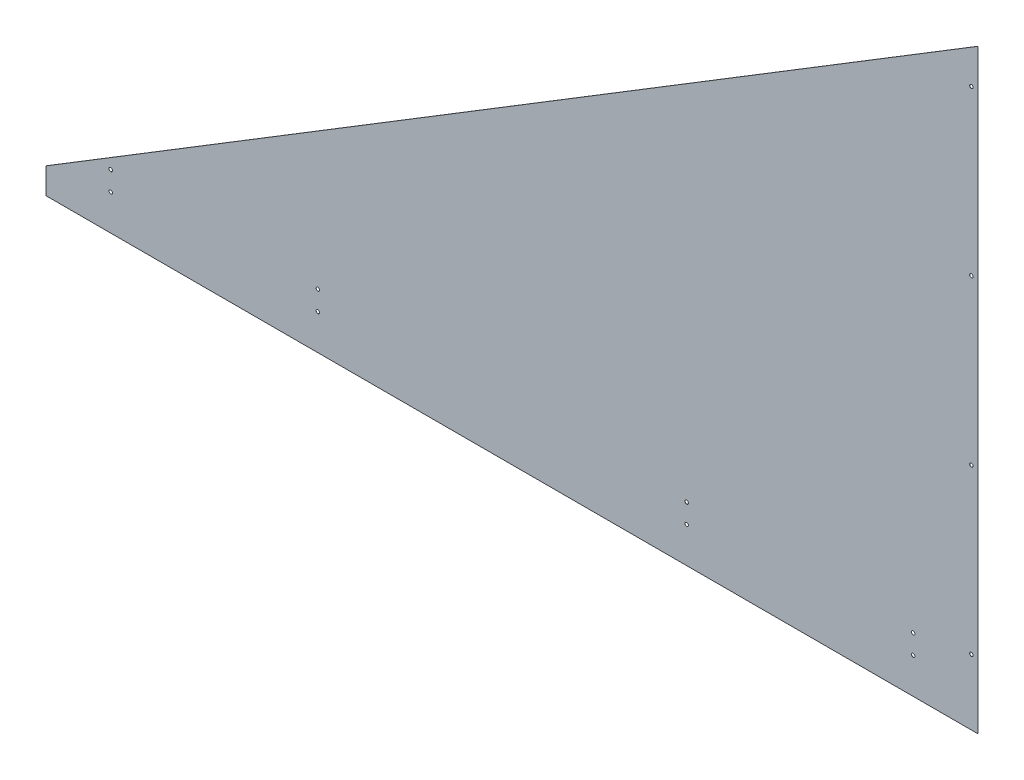
ISO-10303-21;
HEADER;
FILE_DESCRIPTION(('STEP AP214'),'2;1');
FILE_NAME('part.step','',(''),(''),'','','');
FILE_SCHEMA(('AUTOMOTIVE_DESIGN { 1 0 10303 214 1 1 1 1 }'));
ENDSEC;
DATA;
#1=APPLICATION_CONTEXT('core data for automotive mechanical design processes');
#2=APPLICATION_PROTOCOL_DEFINITION('international standard','automotive_design',2000,#1);
#3=PRODUCT_CONTEXT('',#1,'mechanical');
#4=PRODUCT('Part','Part','',(#3));
#5=PRODUCT_RELATED_PRODUCT_CATEGORY('part','',(#4));
#6=PRODUCT_DEFINITION_FORMATION('','',#4);
#7=PRODUCT_DEFINITION_CONTEXT('part definition',#1,'design');
#8=PRODUCT_DEFINITION('design','',#6,#7);
#9=PRODUCT_DEFINITION_SHAPE('','',#8);
#10=(LENGTH_UNIT() NAMED_UNIT(*) SI_UNIT(.MILLI.,.METRE.));
#11=(NAMED_UNIT(*) PLANE_ANGLE_UNIT() SI_UNIT($,.RADIAN.));
#12=(NAMED_UNIT(*) SI_UNIT($,.STERADIAN.) SOLID_ANGLE_UNIT());
#13=UNCERTAINTY_MEASURE_WITH_UNIT(LENGTH_MEASURE(1.E-05),#10,'distance_accuracy_value','');
#14=(GEOMETRIC_REPRESENTATION_CONTEXT(3) GLOBAL_UNCERTAINTY_ASSIGNED_CONTEXT((#13)) GLOBAL_UNIT_ASSIGNED_CONTEXT((#10,
#11,#12)) REPRESENTATION_CONTEXT('',''));
#15=CARTESIAN_POINT('',(0.,0.,0.));
#16=DIRECTION('',(0.,0.,1.));
#17=DIRECTION('',(1.,0.,0.));
#18=AXIS2_PLACEMENT_3D('',#15,#16,#17);
#19=CARTESIAN_POINT('',(0.,0.,0.));
#20=DIRECTION('',(0.,0.,1.));
#21=DIRECTION('',(1.,0.,0.));
#22=AXIS2_PLACEMENT_3D('',#19,#20,#21);
#23=PLANE('',#22);
#24=CARTESIAN_POINT('',(1816.1,77.7875,0.));
#25=DIRECTION('',(0.,0.,-1.));
#26=DIRECTION('',(-1.,0.,0.));
#27=AXIS2_PLACEMENT_3D('',#24,#25,#26);
#28=CIRCLE('',#27,3.3782);
#29=CARTESIAN_POINT('',(1812.7218,77.7875,0.));
#30=VERTEX_POINT('',#29);
#31=EDGE_CURVE('E95',#30,#30,#28,.T.);
#32=ORIENTED_EDGE('',*,*,#31,.F.);
#33=EDGE_LOOP('',(#32));
#34=FACE_BOUND('',#33,.T.);
#35=CARTESIAN_POINT('',(1816.1,399.520833333333,0.));
#36=DIRECTION('',(0.,0.,-1.));
#37=DIRECTION('',(-1.,0.,0.));
#38=AXIS2_PLACEMENT_3D('',#35,#36,#37);
#39=CIRCLE('',#38,3.3782);
#40=CARTESIAN_POINT('',(1812.7218,399.520833333333,0.));
#41=VERTEX_POINT('',#40);
#42=EDGE_CURVE('E103',#41,#41,#39,.T.);
#43=ORIENTED_EDGE('',*,*,#42,.F.);
#44=EDGE_LOOP('',(#43));
#45=FACE_BOUND('',#44,.T.);
#46=CARTESIAN_POINT('',(1816.1,721.254166666667,0.));
#47=DIRECTION('',(0.,0.,-1.));
#48=DIRECTION('',(-1.,0.,0.));
#49=AXIS2_PLACEMENT_3D('',#46,#47,#48);
#50=CIRCLE('',#49,3.3782);
#51=CARTESIAN_POINT('',(1812.7218,721.254166666667,0.));
#52=VERTEX_POINT('',#51);
#53=EDGE_CURVE('E106',#52,#52,#50,.T.);
#54=ORIENTED_EDGE('',*,*,#53,.F.);
#55=EDGE_LOOP('',(#54));
#56=FACE_BOUND('',#55,.T.);
#57=CARTESIAN_POINT('',(1816.1,1042.9875,0.));
#58=DIRECTION('',(0.,0.,-1.));
#59=DIRECTION('',(-1.,0.,0.));
#60=AXIS2_PLACEMENT_3D('',#57,#58,#59);
#61=CIRCLE('',#60,3.3782);
#62=CARTESIAN_POINT('',(1812.7218,1042.9875,0.));
#63=VERTEX_POINT('',#62);
#64=EDGE_CURVE('E109',#63,#63,#61,.T.);
#65=ORIENTED_EDGE('',*,*,#64,.F.);
#66=EDGE_LOOP('',(#65));
#67=FACE_BOUND('',#66,.T.);
#68=CARTESIAN_POINT('',(1701.8,19.05,0.));
#69=DIRECTION('',(0.,0.,-1.));
#70=DIRECTION('',(-1.,0.,0.));
#71=AXIS2_PLACEMENT_3D('',#68,#69,#70);
#72=CIRCLE('',#71,3.3782);
#73=CARTESIAN_POINT('',(1698.4218,19.05,0.));
#74=VERTEX_POINT('',#73);
#75=EDGE_CURVE('E112',#74,#74,#72,.T.);
#76=ORIENTED_EDGE('',*,*,#75,.F.);
#77=EDGE_LOOP('',(#76));
#78=FACE_BOUND('',#77,.T.);
#79=CARTESIAN_POINT('',(1701.8,57.15,0.));
#80=DIRECTION('',(0.,0.,-1.));
#81=DIRECTION('',(-1.,0.,0.));
#82=AXIS2_PLACEMENT_3D('',#79,#80,#81);
#83=CIRCLE('',#82,3.3782);
#84=CARTESIAN_POINT('',(1698.4218,57.15,0.));
#85=VERTEX_POINT('',#84);
#86=EDGE_CURVE('E115',#85,#85,#83,.T.);
#87=ORIENTED_EDGE('',*,*,#86,.F.);
#88=EDGE_LOOP('',(#87));
#89=FACE_BOUND('',#88,.T.);
#90=CARTESIAN_POINT('',(1257.3,57.15,0.));
#91=DIRECTION('',(0.,0.,-1.));
#92=DIRECTION('',(-1.,0.,0.));
#93=AXIS2_PLACEMENT_3D('',#90,#91,#92);
#94=CIRCLE('',#93,3.3782);
#95=CARTESIAN_POINT('',(1253.9218,57.15,0.));
#96=VERTEX_POINT('',#95);
#97=EDGE_CURVE('E118',#96,#96,#94,.T.);
#98=ORIENTED_EDGE('',*,*,#97,.F.);
#99=EDGE_LOOP('',(#98));
#100=FACE_BOUND('',#99,.T.);
#101=CARTESIAN_POINT('',(1257.3,19.05,0.));
#102=DIRECTION('',(0.,0.,-1.));
#103=DIRECTION('',(-1.,0.,0.));
#104=AXIS2_PLACEMENT_3D('',#101,#102,#103);
#105=CIRCLE('',#104,3.3782);
#106=CARTESIAN_POINT('',(1253.9218,19.05,0.));
#107=VERTEX_POINT('',#106);
#108=EDGE_CURVE('E121',#107,#107,#105,.T.);
#109=ORIENTED_EDGE('',*,*,#108,.F.);
#110=EDGE_LOOP('',(#109));
#111=FACE_BOUND('',#110,.T.);
#112=CARTESIAN_POINT('',(533.4,57.15,0.));
#113=DIRECTION('',(0.,0.,-1.));
#114=DIRECTION('',(-1.,0.,0.));
#115=AXIS2_PLACEMENT_3D('',#112,#113,#114);
#116=CIRCLE('',#115,3.3782);
#117=CARTESIAN_POINT('',(530.0218,57.15,0.));
#118=VERTEX_POINT('',#117);
#119=EDGE_CURVE('E124',#118,#118,#116,.T.);
#120=ORIENTED_EDGE('',*,*,#119,.F.);
#121=EDGE_LOOP('',(#120));
#122=FACE_BOUND('',#121,.T.);
#123=CARTESIAN_POINT('',(533.4,19.05,0.));
#124=DIRECTION('',(0.,0.,-1.));
#125=DIRECTION('',(-1.,0.,0.));
#126=AXIS2_PLACEMENT_3D('',#123,#124,#125);
#127=CIRCLE('',#126,3.3782);
#128=CARTESIAN_POINT('',(530.0218,19.05,0.));
#129=VERTEX_POINT('',#128);
#130=EDGE_CURVE('E127',#129,#129,#127,.T.);
#131=ORIENTED_EDGE('',*,*,#130,.F.);
#132=EDGE_LOOP('',(#131));
#133=FACE_BOUND('',#132,.T.);
#134=CARTESIAN_POINT('',(127.,19.05,0.));
#135=DIRECTION('',(0.,0.,-1.));
#136=DIRECTION('',(-1.,0.,0.));
#137=AXIS2_PLACEMENT_3D('',#134,#135,#136);
#138=CIRCLE('',#137,3.3782);
#139=CARTESIAN_POINT('',(123.6218,19.05,0.));
#140=VERTEX_POINT('',#139);
#141=EDGE_CURVE('E133',#140,#140,#138,.T.);
#142=ORIENTED_EDGE('',*,*,#141,.F.);
#143=EDGE_LOOP('',(#142));
#144=FACE_BOUND('',#143,.T.);
#145=DIRECTION('',(0.,1.,0.));
#146=VECTOR('',#145,1.);
#147=CARTESIAN_POINT('',(1828.8,1117.6,0.));
#148=LINE('',#147,#146);
#149=CARTESIAN_POINT('',(1828.8,-50.8,0.));
#150=VERTEX_POINT('',#149);
#151=CARTESIAN_POINT('',(1828.8,1117.6,0.));
#152=VERTEX_POINT('',#151);
#153=EDGE_CURVE('E136',#150,#152,#148,.T.);
#154=ORIENTED_EDGE('',*,*,#153,.F.);
#155=DIRECTION('',(-1.,0.,0.));
#156=VECTOR('',#155,1.);
#157=CARTESIAN_POINT('',(1828.8,-50.8,0.));
#158=LINE('',#157,#156);
#159=CARTESIAN_POINT('',(0.,-50.8,0.));
#160=VERTEX_POINT('',#159);
#161=EDGE_CURVE('E97',#150,#160,#158,.T.);
#162=ORIENTED_EDGE('',*,*,#161,.T.);
#163=DIRECTION('',(0.,1.,0.));
#164=VECTOR('',#163,1.);
#165=CARTESIAN_POINT('',(0.,0.,0.));
#166=LINE('',#165,#164);
#167=CARTESIAN_POINT('',(0.,0.,0.));
#168=VERTEX_POINT('',#167);
#169=EDGE_CURVE('E92',#160,#168,#166,.T.);
#170=ORIENTED_EDGE('',*,*,#169,.T.);
#171=DIRECTION('',(-0.853281833651959,-0.521450009453975,0.));
#172=VECTOR('',#171,1.);
#173=CARTESIAN_POINT('',(0.,0.,0.));
#174=LINE('',#173,#172);
#175=EDGE_CURVE('E138',#152,#168,#174,.T.);
#176=ORIENTED_EDGE('',*,*,#175,.F.);
#177=EDGE_LOOP('',(#154,#162,#170,#176));
#178=FACE_BOUND('',#177,.T.);
#179=CARTESIAN_POINT('',(127.,57.15,0.));
#180=DIRECTION('',(0.,0.,-1.));
#181=DIRECTION('',(-1.,0.,0.));
#182=AXIS2_PLACEMENT_3D('',#179,#180,#181);
#183=CIRCLE('',#182,3.3782);
#184=CARTESIAN_POINT('',(123.6218,57.15,0.));
#185=VERTEX_POINT('',#184);
#186=EDGE_CURVE('E130',#185,#185,#183,.T.);
#187=ORIENTED_EDGE('',*,*,#186,.F.);
#188=EDGE_LOOP('',(#187));
#189=FACE_BOUND('',#188,.T.);
#190=ADVANCED_FACE('F34',(#34,#45,#56,#67,#78,#89,#100,#111,#122,#133,#144,#178,#189),#23,.F.);
#191=CARTESIAN_POINT('',(1828.8,1117.6,3.175));
#192=DIRECTION('',(-1.,0.,0.));
#193=DIRECTION('',(0.,-1.,0.));
#194=AXIS2_PLACEMENT_3D('',#191,#192,#193);
#195=PLANE('',#194);
#196=DIRECTION('',(0.,0.,-1.));
#197=VECTOR('',#196,1.);
#198=CARTESIAN_POINT('',(1828.8,1117.6,3.175));
#199=LINE('',#198,#197);
#200=CARTESIAN_POINT('',(1828.8,1117.6,0.254));
#201=VERTEX_POINT('',#200);
#202=EDGE_CURVE('E11',#201,#152,#199,.T.);
#203=ORIENTED_EDGE('',*,*,#202,.F.);
#204=DIRECTION('',(0.,1.,0.));
#205=VECTOR('',#204,1.);
#206=CARTESIAN_POINT('',(1828.8,-50.8,0.254));
#207=LINE('',#206,#205);
#208=CARTESIAN_POINT('',(1828.8,-50.8,0.254));
#209=VERTEX_POINT('',#208);
#210=EDGE_CURVE('E79',#209,#201,#207,.T.);
#211=ORIENTED_EDGE('',*,*,#210,.F.);
#212=DIRECTION('',(0.,0.,-1.));
#213=VECTOR('',#212,1.);
#214=CARTESIAN_POINT('',(1828.8,-50.8,1832.6804195055));
#215=LINE('',#214,#213);
#216=EDGE_CURVE('E87',#209,#150,#215,.T.);
#217=ORIENTED_EDGE('',*,*,#216,.T.);
#218=ORIENTED_EDGE('',*,*,#153,.T.);
#219=EDGE_LOOP('',(#203,#211,#217,#218));
#220=FACE_BOUND('',#219,.T.);
#221=ADVANCED_FACE('F36',(#220),#195,.F.);
#222=CARTESIAN_POINT('',(0.,0.,3.175));
#223=DIRECTION('',(0.521450009453975,-0.853281833651959,0.));
#224=DIRECTION('',(0.853281833651959,0.521450009453975,0.));
#225=AXIS2_PLACEMENT_3D('',#222,#223,#224);
#226=PLANE('',#225);
#227=DIRECTION('',(0.,0.,-1.));
#228=VECTOR('',#227,1.);
#229=CARTESIAN_POINT('',(0.,0.,3.175));
#230=LINE('',#229,#228);
#231=CARTESIAN_POINT('',(0.,0.,0.253999999999976));
#232=VERTEX_POINT('',#231);
#233=EDGE_CURVE('E42',#232,#168,#230,.T.);
#234=ORIENTED_EDGE('',*,*,#233,.F.);
#235=DIRECTION('',(0.853281833651959,0.521450009453975,0.));
#236=VECTOR('',#235,1.);
#237=CARTESIAN_POINT('',(0.,0.,0.254));
#238=LINE('',#237,#236);
#239=EDGE_CURVE('E49',#232,#201,#238,.T.);
#240=ORIENTED_EDGE('',*,*,#239,.T.);
#241=ORIENTED_EDGE('',*,*,#202,.T.);
#242=ORIENTED_EDGE('',*,*,#175,.T.);
#243=EDGE_LOOP('',(#234,#240,#241,#242));
#244=FACE_BOUND('',#243,.T.);
#245=ADVANCED_FACE('F140',(#244),#226,.F.);
#246=CARTESIAN_POINT('',(127.,19.05,0.));
#247=DIRECTION('',(0.,0.,-1.));
#248=DIRECTION('',(-1.,0.,0.));
#249=AXIS2_PLACEMENT_3D('',#246,#247,#248);
#250=CYLINDRICAL_SURFACE('',#249,3.3782);
#251=CARTESIAN_POINT('',(127.,19.05,0.254));
#252=DIRECTION('',(0.,0.,-1.));
#253=DIRECTION('',(-1.,0.,0.));
#254=AXIS2_PLACEMENT_3D('',#251,#252,#253);
#255=CIRCLE('',#254,3.3782);
#256=CARTESIAN_POINT('',(123.6218,19.05,0.254));
#257=VERTEX_POINT('',#256);
#258=EDGE_CURVE('E144',#257,#257,#255,.F.);
#259=ORIENTED_EDGE('',*,*,#258,.T.);
#260=EDGE_LOOP('',(#259));
#261=FACE_BOUND('',#260,.T.);
#262=ORIENTED_EDGE('',*,*,#141,.T.);
#263=EDGE_LOOP('',(#262));
#264=FACE_BOUND('',#263,.T.);
#265=ADVANCED_FACE('F187',(#261,#264),#250,.F.);
#266=CARTESIAN_POINT('',(127.,57.15,0.));
#267=DIRECTION('',(0.,0.,-1.));
#268=DIRECTION('',(-1.,0.,0.));
#269=AXIS2_PLACEMENT_3D('',#266,#267,#268);
#270=CYLINDRICAL_SURFACE('',#269,3.3782);
#271=CARTESIAN_POINT('',(127.,57.15,0.254));
#272=DIRECTION('',(0.,0.,-1.));
#273=DIRECTION('',(-1.,0.,0.));
#274=AXIS2_PLACEMENT_3D('',#271,#272,#273);
#275=CIRCLE('',#274,3.3782);
#276=CARTESIAN_POINT('',(123.6218,57.15,0.254));
#277=VERTEX_POINT('',#276);
#278=EDGE_CURVE('E147',#277,#277,#275,.F.);
#279=ORIENTED_EDGE('',*,*,#278,.T.);
#280=EDGE_LOOP('',(#279));
#281=FACE_BOUND('',#280,.T.);
#282=ORIENTED_EDGE('',*,*,#186,.T.);
#283=EDGE_LOOP('',(#282));
#284=FACE_BOUND('',#283,.T.);
#285=ADVANCED_FACE('F197',(#281,#284),#270,.F.);
#286=CARTESIAN_POINT('',(533.4,19.05,0.));
#287=DIRECTION('',(0.,0.,-1.));
#288=DIRECTION('',(-1.,0.,0.));
#289=AXIS2_PLACEMENT_3D('',#286,#287,#288);
#290=CYLINDRICAL_SURFACE('',#289,3.3782);
#291=CARTESIAN_POINT('',(533.4,19.05,0.254));
#292=DIRECTION('',(0.,0.,-1.));
#293=DIRECTION('',(-1.,0.,0.));
#294=AXIS2_PLACEMENT_3D('',#291,#292,#293);
#295=CIRCLE('',#294,3.3782);
#296=CARTESIAN_POINT('',(530.0218,19.05,0.254));
#297=VERTEX_POINT('',#296);
#298=EDGE_CURVE('E152',#297,#297,#295,.F.);
#299=ORIENTED_EDGE('',*,*,#298,.T.);
#300=EDGE_LOOP('',(#299));
#301=FACE_BOUND('',#300,.T.);
#302=ORIENTED_EDGE('',*,*,#130,.T.);
#303=EDGE_LOOP('',(#302));
#304=FACE_BOUND('',#303,.T.);
#305=ADVANCED_FACE('F201',(#301,#304),#290,.F.);
#306=CARTESIAN_POINT('',(533.4,57.15,0.));
#307=DIRECTION('',(0.,0.,-1.));
#308=DIRECTION('',(-1.,0.,0.));
#309=AXIS2_PLACEMENT_3D('',#306,#307,#308);
#310=CYLINDRICAL_SURFACE('',#309,3.3782);
#311=CARTESIAN_POINT('',(533.4,57.15,0.254));
#312=DIRECTION('',(0.,0.,-1.));
#313=DIRECTION('',(-1.,0.,0.));
#314=AXIS2_PLACEMENT_3D('',#311,#312,#313);
#315=CIRCLE('',#314,3.3782);
#316=CARTESIAN_POINT('',(530.0218,57.15,0.254));
#317=VERTEX_POINT('',#316);
#318=EDGE_CURVE('E155',#317,#317,#315,.F.);
#319=ORIENTED_EDGE('',*,*,#318,.T.);
#320=EDGE_LOOP('',(#319));
#321=FACE_BOUND('',#320,.T.);
#322=ORIENTED_EDGE('',*,*,#119,.T.);
#323=EDGE_LOOP('',(#322));
#324=FACE_BOUND('',#323,.T.);
#325=ADVANCED_FACE('F205',(#321,#324),#310,.F.);
#326=CARTESIAN_POINT('',(1257.3,19.05,0.));
#327=DIRECTION('',(0.,0.,-1.));
#328=DIRECTION('',(-1.,0.,0.));
#329=AXIS2_PLACEMENT_3D('',#326,#327,#328);
#330=CYLINDRICAL_SURFACE('',#329,3.3782);
#331=CARTESIAN_POINT('',(1257.3,19.05,0.254));
#332=DIRECTION('',(0.,0.,-1.));
#333=DIRECTION('',(-1.,0.,0.));
#334=AXIS2_PLACEMENT_3D('',#331,#332,#333);
#335=CIRCLE('',#334,3.3782);
#336=CARTESIAN_POINT('',(1253.9218,19.05,0.254));
#337=VERTEX_POINT('',#336);
#338=EDGE_CURVE('E158',#337,#337,#335,.F.);
#339=ORIENTED_EDGE('',*,*,#338,.T.);
#340=EDGE_LOOP('',(#339));
#341=FACE_BOUND('',#340,.T.);
#342=ORIENTED_EDGE('',*,*,#108,.T.);
#343=EDGE_LOOP('',(#342));
#344=FACE_BOUND('',#343,.T.);
#345=ADVANCED_FACE('F209',(#341,#344),#330,.F.);
#346=CARTESIAN_POINT('',(1257.3,57.15,0.));
#347=DIRECTION('',(0.,0.,-1.));
#348=DIRECTION('',(-1.,0.,0.));
#349=AXIS2_PLACEMENT_3D('',#346,#347,#348);
#350=CYLINDRICAL_SURFACE('',#349,3.3782);
#351=CARTESIAN_POINT('',(1257.3,57.15,0.254));
#352=DIRECTION('',(0.,0.,-1.));
#353=DIRECTION('',(-1.,0.,0.));
#354=AXIS2_PLACEMENT_3D('',#351,#352,#353);
#355=CIRCLE('',#354,3.3782);
#356=CARTESIAN_POINT('',(1253.9218,57.15,0.254));
#357=VERTEX_POINT('',#356);
#358=EDGE_CURVE('E161',#357,#357,#355,.F.);
#359=ORIENTED_EDGE('',*,*,#358,.T.);
#360=EDGE_LOOP('',(#359));
#361=FACE_BOUND('',#360,.T.);
#362=ORIENTED_EDGE('',*,*,#97,.T.);
#363=EDGE_LOOP('',(#362));
#364=FACE_BOUND('',#363,.T.);
#365=ADVANCED_FACE('F213',(#361,#364),#350,.F.);
#366=CARTESIAN_POINT('',(1701.8,57.15,0.));
#367=DIRECTION('',(0.,0.,-1.));
#368=DIRECTION('',(-1.,0.,0.));
#369=AXIS2_PLACEMENT_3D('',#366,#367,#368);
#370=CYLINDRICAL_SURFACE('',#369,3.3782);
#371=CARTESIAN_POINT('',(1701.8,57.15,0.254));
#372=DIRECTION('',(0.,0.,-1.));
#373=DIRECTION('',(-1.,0.,0.));
#374=AXIS2_PLACEMENT_3D('',#371,#372,#373);
#375=CIRCLE('',#374,3.3782);
#376=CARTESIAN_POINT('',(1698.4218,57.15,0.254));
#377=VERTEX_POINT('',#376);
#378=EDGE_CURVE('E164',#377,#377,#375,.F.);
#379=ORIENTED_EDGE('',*,*,#378,.T.);
#380=EDGE_LOOP('',(#379));
#381=FACE_BOUND('',#380,.T.);
#382=ORIENTED_EDGE('',*,*,#86,.T.);
#383=EDGE_LOOP('',(#382));
#384=FACE_BOUND('',#383,.T.);
#385=ADVANCED_FACE('F217',(#381,#384),#370,.F.);
#386=CARTESIAN_POINT('',(1701.8,19.05,0.));
#387=DIRECTION('',(0.,0.,-1.));
#388=DIRECTION('',(-1.,0.,0.));
#389=AXIS2_PLACEMENT_3D('',#386,#387,#388);
#390=CYLINDRICAL_SURFACE('',#389,3.3782);
#391=CARTESIAN_POINT('',(1701.8,19.05,0.254));
#392=DIRECTION('',(0.,0.,-1.));
#393=DIRECTION('',(-1.,0.,0.));
#394=AXIS2_PLACEMENT_3D('',#391,#392,#393);
#395=CIRCLE('',#394,3.3782);
#396=CARTESIAN_POINT('',(1698.4218,19.05,0.254));
#397=VERTEX_POINT('',#396);
#398=EDGE_CURVE('E167',#397,#397,#395,.F.);
#399=ORIENTED_EDGE('',*,*,#398,.T.);
#400=EDGE_LOOP('',(#399));
#401=FACE_BOUND('',#400,.T.);
#402=ORIENTED_EDGE('',*,*,#75,.T.);
#403=EDGE_LOOP('',(#402));
#404=FACE_BOUND('',#403,.T.);
#405=ADVANCED_FACE('F221',(#401,#404),#390,.F.);
#406=CARTESIAN_POINT('',(1816.1,1042.9875,0.));
#407=DIRECTION('',(0.,0.,-1.));
#408=DIRECTION('',(-1.,0.,0.));
#409=AXIS2_PLACEMENT_3D('',#406,#407,#408);
#410=CYLINDRICAL_SURFACE('',#409,3.3782);
#411=CARTESIAN_POINT('',(1816.1,1042.9875,0.254));
#412=DIRECTION('',(0.,0.,-1.));
#413=DIRECTION('',(-1.,0.,0.));
#414=AXIS2_PLACEMENT_3D('',#411,#412,#413);
#415=CIRCLE('',#414,3.3782);
#416=CARTESIAN_POINT('',(1812.7218,1042.9875,0.254));
#417=VERTEX_POINT('',#416);
#418=EDGE_CURVE('E170',#417,#417,#415,.F.);
#419=ORIENTED_EDGE('',*,*,#418,.T.);
#420=EDGE_LOOP('',(#419));
#421=FACE_BOUND('',#420,.T.);
#422=ORIENTED_EDGE('',*,*,#64,.T.);
#423=EDGE_LOOP('',(#422));
#424=FACE_BOUND('',#423,.T.);
#425=ADVANCED_FACE('F225',(#421,#424),#410,.F.);
#426=CARTESIAN_POINT('',(1816.1,721.254166666667,0.));
#427=DIRECTION('',(0.,0.,-1.));
#428=DIRECTION('',(-1.,0.,0.));
#429=AXIS2_PLACEMENT_3D('',#426,#427,#428);
#430=CYLINDRICAL_SURFACE('',#429,3.3782);
#431=CARTESIAN_POINT('',(1816.1,721.254166666667,0.254));
#432=DIRECTION('',(0.,0.,-1.));
#433=DIRECTION('',(-1.,0.,0.));
#434=AXIS2_PLACEMENT_3D('',#431,#432,#433);
#435=CIRCLE('',#434,3.3782);
#436=CARTESIAN_POINT('',(1812.7218,721.254166666667,0.254));
#437=VERTEX_POINT('',#436);
#438=EDGE_CURVE('E173',#437,#437,#435,.F.);
#439=ORIENTED_EDGE('',*,*,#438,.T.);
#440=EDGE_LOOP('',(#439));
#441=FACE_BOUND('',#440,.T.);
#442=ORIENTED_EDGE('',*,*,#53,.T.);
#443=EDGE_LOOP('',(#442));
#444=FACE_BOUND('',#443,.T.);
#445=ADVANCED_FACE('F229',(#441,#444),#430,.F.);
#446=CARTESIAN_POINT('',(1816.1,399.520833333333,0.));
#447=DIRECTION('',(0.,0.,-1.));
#448=DIRECTION('',(-1.,0.,0.));
#449=AXIS2_PLACEMENT_3D('',#446,#447,#448);
#450=CYLINDRICAL_SURFACE('',#449,3.3782);
#451=CARTESIAN_POINT('',(1816.1,399.520833333333,0.254));
#452=DIRECTION('',(0.,0.,-1.));
#453=DIRECTION('',(-1.,0.,0.));
#454=AXIS2_PLACEMENT_3D('',#451,#452,#453);
#455=CIRCLE('',#454,3.3782);
#456=CARTESIAN_POINT('',(1812.7218,399.520833333333,0.254));
#457=VERTEX_POINT('',#456);
#458=EDGE_CURVE('E176',#457,#457,#455,.F.);
#459=ORIENTED_EDGE('',*,*,#458,.T.);
#460=EDGE_LOOP('',(#459));
#461=FACE_BOUND('',#460,.T.);
#462=ORIENTED_EDGE('',*,*,#42,.T.);
#463=EDGE_LOOP('',(#462));
#464=FACE_BOUND('',#463,.T.);
#465=ADVANCED_FACE('F233',(#461,#464),#450,.F.);
#466=CARTESIAN_POINT('',(1816.1,77.7875,0.));
#467=DIRECTION('',(0.,0.,-1.));
#468=DIRECTION('',(-1.,0.,0.));
#469=AXIS2_PLACEMENT_3D('',#466,#467,#468);
#470=CYLINDRICAL_SURFACE('',#469,3.3782);
#471=CARTESIAN_POINT('',(1816.1,77.7875,0.254));
#472=DIRECTION('',(0.,0.,-1.));
#473=DIRECTION('',(-1.,0.,0.));
#474=AXIS2_PLACEMENT_3D('',#471,#472,#473);
#475=CIRCLE('',#474,3.3782);
#476=CARTESIAN_POINT('',(1812.7218,77.7875,0.254));
#477=VERTEX_POINT('',#476);
#478=EDGE_CURVE('E88',#477,#477,#475,.F.);
#479=ORIENTED_EDGE('',*,*,#478,.T.);
#480=EDGE_LOOP('',(#479));
#481=FACE_BOUND('',#480,.T.);
#482=ORIENTED_EDGE('',*,*,#31,.T.);
#483=EDGE_LOOP('',(#482));
#484=FACE_BOUND('',#483,.T.);
#485=ADVANCED_FACE('F237',(#481,#484),#470,.F.);
#486=CARTESIAN_POINT('',(1828.8,-50.8,1832.6804195055));
#487=DIRECTION('',(0.,-1.,0.));
#488=DIRECTION('',(0.,0.,-1.));
#489=AXIS2_PLACEMENT_3D('',#486,#487,#488);
#490=PLANE('',#489);
#491=DIRECTION('',(1.,0.,0.));
#492=VECTOR('',#491,1.);
#493=CARTESIAN_POINT('',(0.,-50.8000000000007,0.254));
#494=LINE('',#493,#492);
#495=CARTESIAN_POINT('',(0.,-50.8000000000007,0.254));
#496=VERTEX_POINT('',#495);
#497=EDGE_CURVE('E74',#496,#209,#494,.T.);
#498=ORIENTED_EDGE('',*,*,#497,.F.);
#499=DIRECTION('',(0.,0.,-1.));
#500=VECTOR('',#499,1.);
#501=CARTESIAN_POINT('',(0.,-50.8,1832.6804195055));
#502=LINE('',#501,#500);
#503=EDGE_CURVE('E85',#496,#160,#502,.T.);
#504=ORIENTED_EDGE('',*,*,#503,.T.);
#505=ORIENTED_EDGE('',*,*,#161,.F.);
#506=ORIENTED_EDGE('',*,*,#216,.F.);
#507=EDGE_LOOP('',(#498,#504,#505,#506));
#508=FACE_BOUND('',#507,.T.);
#509=ADVANCED_FACE('F83',(#508),#490,.T.);
#510=CARTESIAN_POINT('',(0.,0.,1832.6804195055));
#511=DIRECTION('',(-1.,0.,0.));
#512=DIRECTION('',(0.,0.,1.));
#513=AXIS2_PLACEMENT_3D('',#510,#511,#512);
#514=PLANE('',#513);
#515=DIRECTION('',(0.,1.,0.));
#516=VECTOR('',#515,1.);
#517=CARTESIAN_POINT('',(0.,-50.8000000000007,0.254));
#518=LINE('',#517,#516);
#519=EDGE_CURVE('E71',#496,#232,#518,.T.);
#520=ORIENTED_EDGE('',*,*,#519,.T.);
#521=ORIENTED_EDGE('',*,*,#233,.T.);
#522=ORIENTED_EDGE('',*,*,#169,.F.);
#523=ORIENTED_EDGE('',*,*,#503,.F.);
#524=EDGE_LOOP('',(#520,#521,#522,#523));
#525=FACE_BOUND('',#524,.T.);
#526=ADVANCED_FACE('F90',(#525),#514,.T.);
#527=CARTESIAN_POINT('',(0.,-50.8000000000007,0.254));
#528=DIRECTION('',(0.,0.,-1.));
#529=DIRECTION('',(-1.,0.,0.));
#530=AXIS2_PLACEMENT_3D('',#527,#528,#529);
#531=PLANE('',#530);
#532=ORIENTED_EDGE('',*,*,#278,.F.);
#533=EDGE_LOOP('',(#532));
#534=FACE_BOUND('',#533,.T.);
#535=ORIENTED_EDGE('',*,*,#318,.F.);
#536=EDGE_LOOP('',(#535));
#537=FACE_BOUND('',#536,.T.);
#538=ORIENTED_EDGE('',*,*,#358,.F.);
#539=EDGE_LOOP('',(#538));
#540=FACE_BOUND('',#539,.T.);
#541=ORIENTED_EDGE('',*,*,#398,.F.);
#542=EDGE_LOOP('',(#541));
#543=FACE_BOUND('',#542,.T.);
#544=ORIENTED_EDGE('',*,*,#438,.F.);
#545=EDGE_LOOP('',(#544));
#546=FACE_BOUND('',#545,.T.);
#547=ORIENTED_EDGE('',*,*,#478,.F.);
#548=EDGE_LOOP('',(#547));
#549=FACE_BOUND('',#548,.T.);
#550=ORIENTED_EDGE('',*,*,#458,.F.);
#551=EDGE_LOOP('',(#550));
#552=FACE_BOUND('',#551,.T.);
#553=ORIENTED_EDGE('',*,*,#418,.F.);
#554=EDGE_LOOP('',(#553));
#555=FACE_BOUND('',#554,.T.);
#556=ORIENTED_EDGE('',*,*,#378,.F.);
#557=EDGE_LOOP('',(#556));
#558=FACE_BOUND('',#557,.T.);
#559=ORIENTED_EDGE('',*,*,#338,.F.);
#560=EDGE_LOOP('',(#559));
#561=FACE_BOUND('',#560,.T.);
#562=ORIENTED_EDGE('',*,*,#298,.F.);
#563=EDGE_LOOP('',(#562));
#564=FACE_BOUND('',#563,.T.);
#565=ORIENTED_EDGE('',*,*,#258,.F.);
#566=EDGE_LOOP('',(#565));
#567=FACE_BOUND('',#566,.T.);
#568=ORIENTED_EDGE('',*,*,#519,.F.);
#569=ORIENTED_EDGE('',*,*,#497,.T.);
#570=ORIENTED_EDGE('',*,*,#210,.T.);
#571=ORIENTED_EDGE('',*,*,#239,.F.);
#572=EDGE_LOOP('',(#568,#569,#570,#571));
#573=FACE_BOUND('',#572,.T.);
#574=ADVANCED_FACE('F73',(#534,#537,#540,#543,#546,#549,#552,#555,#558,#561,#564,#567,#573),
#531,.F.);
#575=CLOSED_SHELL('',(#190,#221,#245,#265,#285,#305,#325,#345,#365,#385,#405,#425,#445,#465,
#485,#509,#526,#574));
#576=MANIFOLD_SOLID_BREP('B2',#575);
#577=ADVANCED_BREP_SHAPE_REPRESENTATION('',(#18,#576),#14);
#578=SHAPE_DEFINITION_REPRESENTATION(#9,#577);
ENDSEC;
END-ISO-10303-21;
